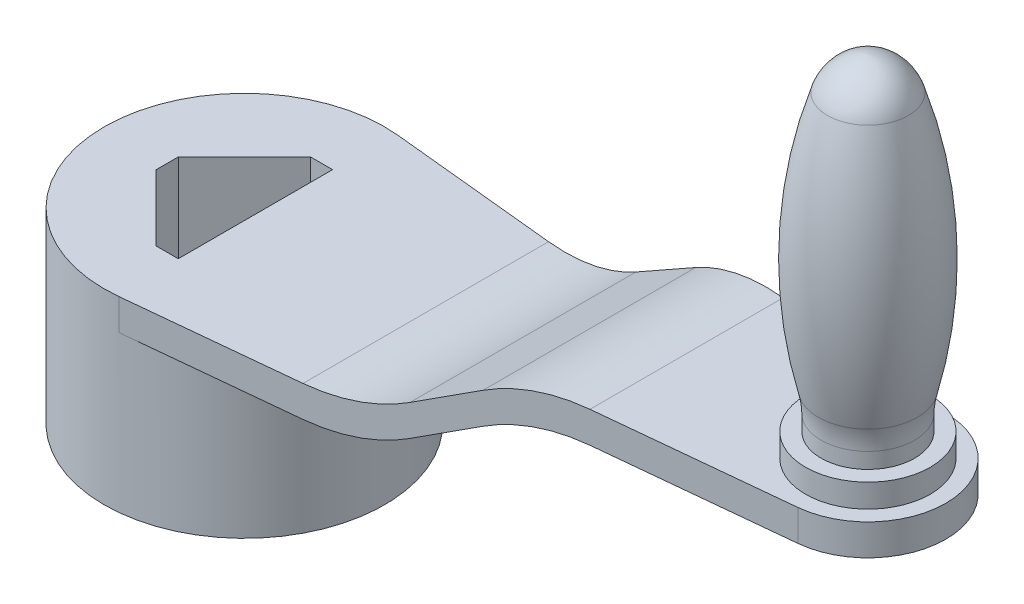
ISO-10303-21;
HEADER;
FILE_DESCRIPTION(('STEP AP214'),'2;1');
FILE_NAME('part.step','',(''),(''),'','','');
FILE_SCHEMA(('AUTOMOTIVE_DESIGN { 1 0 10303 214 1 1 1 1 }'));
ENDSEC;
DATA;
#1=APPLICATION_CONTEXT('core data for automotive mechanical design processes');
#2=APPLICATION_PROTOCOL_DEFINITION('international standard','automotive_design',2000,#1);
#3=PRODUCT_CONTEXT('',#1,'mechanical');
#4=PRODUCT('Part','Part','',(#3));
#5=PRODUCT_RELATED_PRODUCT_CATEGORY('part','',(#4));
#6=PRODUCT_DEFINITION_FORMATION('','',#4);
#7=PRODUCT_DEFINITION_CONTEXT('part definition',#1,'design');
#8=PRODUCT_DEFINITION('design','',#6,#7);
#9=PRODUCT_DEFINITION_SHAPE('','',#8);
#10=(LENGTH_UNIT() NAMED_UNIT(*) SI_UNIT(.MILLI.,.METRE.));
#11=(NAMED_UNIT(*) PLANE_ANGLE_UNIT() SI_UNIT($,.RADIAN.));
#12=(NAMED_UNIT(*) SI_UNIT($,.STERADIAN.) SOLID_ANGLE_UNIT());
#13=UNCERTAINTY_MEASURE_WITH_UNIT(LENGTH_MEASURE(1.E-05),#10,'distance_accuracy_value','');
#14=(GEOMETRIC_REPRESENTATION_CONTEXT(3) GLOBAL_UNCERTAINTY_ASSIGNED_CONTEXT((#13)) GLOBAL_UNIT_ASSIGNED_CONTEXT((#10,
#11,#12)) REPRESENTATION_CONTEXT('',''));
#15=CARTESIAN_POINT('',(0.,0.,0.));
#16=DIRECTION('',(0.,0.,1.));
#17=DIRECTION('',(1.,0.,0.));
#18=AXIS2_PLACEMENT_3D('',#15,#16,#17);
#19=CARTESIAN_POINT('',(141.822000133057,0.42851454593254,45.));
#20=DIRECTION('',(0.,0.,-1.));
#21=DIRECTION('',(-1.,0.,0.));
#22=AXIS2_PLACEMENT_3D('',#19,#20,#21);
#23=CYLINDRICAL_SURFACE('',#22,60.0000000000006);
#24=CARTESIAN_POINT('',(141.822000133057,0.42851454593254,30.9730543697226));
#25=DIRECTION('',(0.1,0.,0.99498743710662));
#26=DIRECTION('',(0.99498743710662,0.,-0.1));
#27=AXIS2_PLACEMENT_3D('',#24,#25,#26);
#28=ELLIPSE('',#27,60.3022689155533,60.0000000000006);
#29=CARTESIAN_POINT('',(141.822000133057,60.4285145459332,30.9730543697226));
#30=VERTEX_POINT('',#29);
#31=CARTESIAN_POINT('',(110.629871748391,51.683281415313,34.1079812262236));
#32=VERTEX_POINT('',#31);
#33=EDGE_CURVE('E326',#30,#32,#28,.T.);
#34=ORIENTED_EDGE('',*,*,#33,.F.);
#35=DIRECTION('',(0.,0.,-1.));
#36=VECTOR('',#35,1.);
#37=CARTESIAN_POINT('',(141.822000133058,60.4285145459332,45.));
#38=LINE('',#37,#36);
#39=CARTESIAN_POINT('',(141.822000133057,60.4285145459332,-30.9730543697226));
#40=VERTEX_POINT('',#39);
#41=EDGE_CURVE('E344',#30,#40,#38,.T.);
#42=ORIENTED_EDGE('',*,*,#41,.T.);
#43=CARTESIAN_POINT('',(141.822000133057,0.42851454593254,-30.9730543697226));
#44=DIRECTION('',(-0.1,0.,0.99498743710662));
#45=DIRECTION('',(-0.99498743710662,0.,-0.1));
#46=AXIS2_PLACEMENT_3D('',#43,#44,#45);
#47=ELLIPSE('',#46,60.3022689155533,60.0000000000006);
#48=CARTESIAN_POINT('',(110.629871748391,51.683281415313,-34.1079812262236));
#49=VERTEX_POINT('',#48);
#50=EDGE_CURVE('E785',#40,#49,#47,.T.);
#51=ORIENTED_EDGE('',*,*,#50,.T.);
#52=DIRECTION('',(0.,0.,-1.));
#53=VECTOR('',#52,1.);
#54=CARTESIAN_POINT('',(110.629871748391,51.6832814153132,45.));
#55=LINE('',#54,#53);
#56=EDGE_CURVE('E336',#32,#49,#55,.T.);
#57=ORIENTED_EDGE('',*,*,#56,.F.);
#58=EDGE_LOOP('',(#34,#42,#51,#57));
#59=FACE_BOUND('',#58,.T.);
#60=ADVANCED_FACE('F43',(#59),#23,.T.);
#61=CARTESIAN_POINT('',(0.,30.,0.));
#62=DIRECTION('',(0.,1.,0.));
#63=DIRECTION('',(0.,0.,1.));
#64=AXIS2_PLACEMENT_3D('',#61,#62,#63);
#65=PLANE('',#64);
#66=DIRECTION('',(0.,0.,-1.));
#67=VECTOR('',#66,1.);
#68=CARTESIAN_POINT('',(3.53553390593271,30.,45.));
#69=LINE('',#68,#67);
#70=CARTESIAN_POINT('',(3.53553390593271,30.,24.7487373415291));
#71=VERTEX_POINT('',#70);
#72=CARTESIAN_POINT('',(3.53553390593271,30.,-24.7487373415291));
#73=VERTEX_POINT('',#72);
#74=EDGE_CURVE('E363',#71,#73,#69,.T.);
#75=ORIENTED_EDGE('',*,*,#74,.F.);
#76=DIRECTION('',(1.,0.,0.));
#77=VECTOR('',#76,1.);
#78=CARTESIAN_POINT('',(3.53553390593271,30.,24.7487373415291));
#79=LINE('',#78,#77);
#80=CARTESIAN_POINT('',(-3.53553390593275,30.,24.7487373415291));
#81=VERTEX_POINT('',#80);
#82=EDGE_CURVE('E378',#81,#71,#79,.T.);
#83=ORIENTED_EDGE('',*,*,#82,.F.);
#84=DIRECTION('',(0.707106781186549,0.,0.707106781186546));
#85=VECTOR('',#84,1.);
#86=CARTESIAN_POINT('',(-3.53553390593275,30.,24.7487373415291));
#87=LINE('',#86,#85);
#88=CARTESIAN_POINT('',(-24.7487373415292,30.,3.53553390593273));
#89=VERTEX_POINT('',#88);
#90=EDGE_CURVE('E383',#89,#81,#87,.T.);
#91=ORIENTED_EDGE('',*,*,#90,.F.);
#92=DIRECTION('',(0.,0.,1.));
#93=VECTOR('',#92,1.);
#94=CARTESIAN_POINT('',(-24.7487373415292,30.,3.53553390593273));
#95=LINE('',#94,#93);
#96=CARTESIAN_POINT('',(-24.7487373415292,30.,-3.53553390593273));
#97=VERTEX_POINT('',#96);
#98=EDGE_CURVE('E419',#97,#89,#95,.T.);
#99=ORIENTED_EDGE('',*,*,#98,.F.);
#100=DIRECTION('',(-0.707106781186549,0.,0.707106781186546));
#101=VECTOR('',#100,1.);
#102=CARTESIAN_POINT('',(-24.7487373415292,30.,-3.53553390593273));
#103=LINE('',#102,#101);
#104=CARTESIAN_POINT('',(-3.53553390593274,30.,-24.7487373415291));
#105=VERTEX_POINT('',#104);
#106=EDGE_CURVE('E415',#105,#97,#103,.T.);
#107=ORIENTED_EDGE('',*,*,#106,.F.);
#108=DIRECTION('',(-1.,0.,0.));
#109=VECTOR('',#108,1.);
#110=CARTESIAN_POINT('',(-3.53553390593274,30.,-24.7487373415291));
#111=LINE('',#110,#109);
#112=EDGE_CURVE('E411',#73,#105,#111,.T.);
#113=ORIENTED_EDGE('',*,*,#112,.F.);
#114=EDGE_LOOP('',(#75,#83,#91,#99,#107,#113));
#115=FACE_BOUND('',#114,.T.);
#116=CARTESIAN_POINT('',(0.,30.,0.));
#117=DIRECTION('',(0.,1.,0.));
#118=DIRECTION('',(0.,0.,1.));
#119=AXIS2_PLACEMENT_3D('',#116,#117,#118);
#120=CIRCLE('',#119,45.);
#121=CARTESIAN_POINT('',(4.50000000000037,30.,-44.7744346697979));
#122=VERTEX_POINT('',#121);
#123=CARTESIAN_POINT('',(4.50000000000037,30.,44.7744346697979));
#124=VERTEX_POINT('',#123);
#125=EDGE_CURVE('E289',#122,#124,#120,.T.);
#126=ORIENTED_EDGE('',*,*,#125,.T.);
#127=DIRECTION('',(0.99498743710662,0.,-0.1));
#128=VECTOR('',#127,1.);
#129=CARTESIAN_POINT('',(4.50000000000001,30.,44.7744346697979));
#130=LINE('',#129,#128);
#131=CARTESIAN_POINT('',(58.1779998669424,29.9999999999999,39.3795926984223));
#132=VERTEX_POINT('',#131);
#133=EDGE_CURVE('E313',#124,#132,#130,.T.);
#134=ORIENTED_EDGE('',*,*,#133,.T.);
#135=DIRECTION('',(0.,0.,-1.));
#136=VECTOR('',#135,1.);
#137=CARTESIAN_POINT('',(58.1779998669424,29.9999999999999,45.));
#138=LINE('',#137,#136);
#139=CARTESIAN_POINT('',(58.1779998669424,29.9999999999999,-39.3795926984223));
#140=VERTEX_POINT('',#139);
#141=EDGE_CURVE('E322',#132,#140,#138,.T.);
#142=ORIENTED_EDGE('',*,*,#141,.T.);
#143=DIRECTION('',(0.99498743710662,0.,0.1));
#144=VECTOR('',#143,1.);
#145=CARTESIAN_POINT('',(4.50000000000001,30.,-44.7744346697979));
#146=LINE('',#145,#144);
#147=EDGE_CURVE('E782',#122,#140,#146,.T.);
#148=ORIENTED_EDGE('',*,*,#147,.F.);
#149=EDGE_LOOP('',(#126,#134,#142,#148));
#150=FACE_BOUND('',#149,.T.);
#151=ADVANCED_FACE('F202',(#115,#150),#65,.T.);
#152=CARTESIAN_POINT('',(200.,50.4285145459325,45.));
#153=DIRECTION('',(0.,1.,0.));
#154=DIRECTION('',(0.,0.,1.));
#155=AXIS2_PLACEMENT_3D('',#152,#153,#154);
#156=PLANE('',#155);
#157=DIRECTION('',(0.99498743710662,0.,-0.1));
#158=VECTOR('',#157,1.);
#159=CARTESIAN_POINT('',(198.02255653302,50.4285145459325,25.3246859276655));
#160=LINE('',#159,#158);
#161=CARTESIAN_POINT('',(141.822000133057,50.4285145459327,30.9730543697227));
#162=VERTEX_POINT('',#161);
#163=CARTESIAN_POINT('',(202.5,50.4285145459325,24.8746859276655));
#164=VERTEX_POINT('',#163);
#165=EDGE_CURVE('E796',#162,#164,#160,.T.);
#166=ORIENTED_EDGE('',*,*,#165,.F.);
#167=DIRECTION('',(0.,0.,-1.));
#168=VECTOR('',#167,1.);
#169=CARTESIAN_POINT('',(141.822000133057,50.4285145459327,45.));
#170=LINE('',#169,#168);
#171=CARTESIAN_POINT('',(141.822000133057,50.4285145459325,-30.9730543697227));
#172=VERTEX_POINT('',#171);
#173=EDGE_CURVE('E347',#162,#172,#170,.T.);
#174=ORIENTED_EDGE('',*,*,#173,.T.);
#175=DIRECTION('',(0.99498743710662,0.,0.1));
#176=VECTOR('',#175,1.);
#177=CARTESIAN_POINT('',(206.97744346698,50.4285145459325,-24.4246859276655));
#178=LINE('',#177,#176);
#179=CARTESIAN_POINT('',(202.5,50.4285145459325,-24.8746859276655));
#180=VERTEX_POINT('',#179);
#181=EDGE_CURVE('E778',#172,#180,#178,.T.);
#182=ORIENTED_EDGE('',*,*,#181,.T.);
#183=CARTESIAN_POINT('',(200.,50.4285145459325,0.));
#184=DIRECTION('',(0.,1.,0.));
#185=DIRECTION('',(0.,0.,1.));
#186=AXIS2_PLACEMENT_3D('',#183,#184,#185);
#187=CIRCLE('',#186,25.);
#188=EDGE_CURVE('E332',#164,#180,#187,.T.);
#189=ORIENTED_EDGE('',*,*,#188,.F.);
#190=EDGE_LOOP('',(#166,#174,#182,#189));
#191=FACE_BOUND('',#190,.T.);
#192=ADVANCED_FACE('F208',(#191),#156,.F.);
#193=CARTESIAN_POINT('',(3.53553390593272,20.,45.));
#194=DIRECTION('',(0.,1.,0.));
#195=DIRECTION('',(-1.,0.,0.));
#196=AXIS2_PLACEMENT_3D('',#193,#194,#195);
#197=PLANE('',#196);
#198=DIRECTION('',(0.99498743710662,0.,-0.1));
#199=VECTOR('',#198,1.);
#200=CARTESIAN_POINT('',(3.5227350998936,20.,44.8726534878112));
#201=LINE('',#200,#199);
#202=CARTESIAN_POINT('',(4.50000000000037,20.,44.7744346697979));
#203=VERTEX_POINT('',#202);
#204=CARTESIAN_POINT('',(58.1779998669417,20.,39.3795926984224));
#205=VERTEX_POINT('',#204);
#206=EDGE_CURVE('E761',#203,#205,#201,.T.);
#207=ORIENTED_EDGE('',*,*,#206,.F.);
#208=CARTESIAN_POINT('',(0.,20.,0.));
#209=DIRECTION('',(0.,1.,0.));
#210=DIRECTION('',(-1.,0.,0.));
#211=AXIS2_PLACEMENT_3D('',#208,#209,#210);
#212=CIRCLE('',#211,45.);
#213=CARTESIAN_POINT('',(4.50000000000037,20.,-44.7744346697979));
#214=VERTEX_POINT('',#213);
#215=EDGE_CURVE('E371',#203,#214,#212,.T.);
#216=ORIENTED_EDGE('',*,*,#215,.T.);
#217=DIRECTION('',(0.99498743710662,0.,0.1));
#218=VECTOR('',#217,1.);
#219=CARTESIAN_POINT('',(12.4776220338532,20.,-43.9726534878112));
#220=LINE('',#219,#218);
#221=CARTESIAN_POINT('',(58.1779998669417,20.,-39.3795926984224));
#222=VERTEX_POINT('',#221);
#223=EDGE_CURVE('E338',#214,#222,#220,.T.);
#224=ORIENTED_EDGE('',*,*,#223,.T.);
#225=DIRECTION('',(0.,0.,-1.));
#226=VECTOR('',#225,1.);
#227=CARTESIAN_POINT('',(58.1779998669417,20.,45.));
#228=LINE('',#227,#226);
#229=EDGE_CURVE('E356',#205,#222,#228,.T.);
#230=ORIENTED_EDGE('',*,*,#229,.F.);
#231=EDGE_LOOP('',(#207,#216,#224,#230));
#232=FACE_BOUND('',#231,.T.);
#233=ADVANCED_FACE('F223',(#232),#197,.F.);
#234=CARTESIAN_POINT('',(58.1779998669427,80.,45.));
#235=DIRECTION('',(0.,0.,-1.));
#236=DIRECTION('',(-1.,0.,0.));
#237=AXIS2_PLACEMENT_3D('',#234,#235,#236);
#238=CYLINDRICAL_SURFACE('',#237,59.9999999999997);
#239=CARTESIAN_POINT('',(58.1779998669427,80.,39.3795926984223));
#240=DIRECTION('',(0.1,0.,0.99498743710662));
#241=DIRECTION('',(0.99498743710662,0.,-0.1));
#242=AXIS2_PLACEMENT_3D('',#239,#240,#241);
#243=ELLIPSE('',#242,60.3022689155524,59.9999999999997);
#244=CARTESIAN_POINT('',(89.3701282516084,28.7452331306203,36.2446658419214));
#245=VERTEX_POINT('',#244);
#246=EDGE_CURVE('E803',#205,#245,#243,.T.);
#247=ORIENTED_EDGE('',*,*,#246,.F.);
#248=ORIENTED_EDGE('',*,*,#229,.T.);
#249=CARTESIAN_POINT('',(58.1779998669427,80.,-39.3795926984223));
#250=DIRECTION('',(-0.1,0.,0.99498743710662));
#251=DIRECTION('',(-0.99498743710662,0.,-0.1));
#252=AXIS2_PLACEMENT_3D('',#249,#250,#251);
#253=ELLIPSE('',#252,60.3022689155524,59.9999999999997);
#254=CARTESIAN_POINT('',(89.3701282516084,28.7452331306203,-36.2446658419214));
#255=VERTEX_POINT('',#254);
#256=EDGE_CURVE('E765',#222,#255,#253,.T.);
#257=ORIENTED_EDGE('',*,*,#256,.T.);
#258=DIRECTION('',(0.,0.,-1.));
#259=VECTOR('',#258,1.);
#260=CARTESIAN_POINT('',(89.3701282516084,28.74523313062,45.));
#261=LINE('',#260,#259);
#262=EDGE_CURVE('E353',#245,#255,#261,.T.);
#263=ORIENTED_EDGE('',*,*,#262,.F.);
#264=EDGE_LOOP('',(#247,#248,#257,#263));
#265=FACE_BOUND('',#264,.T.);
#266=ADVANCED_FACE('F232',(#265),#238,.T.);
#267=CARTESIAN_POINT('',(89.3701282516082,28.7452331306202,45.));
#268=DIRECTION('',(-0.519868806411113,0.854246114489662,0.));
#269=DIRECTION('',(-0.854246114489662,-0.519868806411113,0.));
#270=AXIS2_PLACEMENT_3D('',#267,#268,#269);
#271=PLANE('',#270);
#272=DIRECTION('',(0.851115057254111,0.517963337998391,-0.0855402817676892));
#273=VECTOR('',#272,1.);
#274=CARTESIAN_POINT('',(88.732699459372,28.3573129050891,36.3087298459946));
#275=LINE('',#274,#273);
#276=CARTESIAN_POINT('',(110.62987174839,41.683281415313,34.1079812262237));
#277=VERTEX_POINT('',#276);
#278=EDGE_CURVE('E806',#245,#277,#275,.T.);
#279=ORIENTED_EDGE('',*,*,#278,.F.);
#280=ORIENTED_EDGE('',*,*,#262,.T.);
#281=DIRECTION('',(0.851115057254111,0.517963337998391,0.0855402817676892));
#282=VECTOR('',#281,1.);
#283=CARTESIAN_POINT('',(95.2851154226536,32.3449185940834,-35.650187263554));
#284=LINE('',#283,#282);
#285=CARTESIAN_POINT('',(110.62987174839,41.683281415313,-34.1079812262237));
#286=VERTEX_POINT('',#285);
#287=EDGE_CURVE('E768',#255,#286,#284,.T.);
#288=ORIENTED_EDGE('',*,*,#287,.T.);
#289=DIRECTION('',(0.,0.,-1.));
#290=VECTOR('',#289,1.);
#291=CARTESIAN_POINT('',(110.62987174839,41.683281415313,45.));
#292=LINE('',#291,#290);
#293=EDGE_CURVE('E350',#277,#286,#292,.T.);
#294=ORIENTED_EDGE('',*,*,#293,.F.);
#295=EDGE_LOOP('',(#279,#280,#288,#294));
#296=FACE_BOUND('',#295,.T.);
#297=ADVANCED_FACE('F228',(#296),#271,.F.);
#298=CARTESIAN_POINT('',(141.822000133057,-9.57148545406746,45.));
#299=DIRECTION('',(0.,0.,-1.));
#300=DIRECTION('',(-1.,0.,0.));
#301=AXIS2_PLACEMENT_3D('',#298,#299,#300);
#302=CYLINDRICAL_SURFACE('',#301,60.0000000000002);
#303=CARTESIAN_POINT('',(141.822000133057,-9.57148545406746,30.9730543697226));
#304=DIRECTION('',(0.1,0.,0.99498743710662));
#305=DIRECTION('',(0.99498743710662,0.,-0.1));
#306=AXIS2_PLACEMENT_3D('',#303,#304,#305);
#307=ELLIPSE('',#306,60.3022689155529,60.0000000000002);
#308=EDGE_CURVE('E325',#277,#162,#307,.F.);
#309=ORIENTED_EDGE('',*,*,#308,.F.);
#310=ORIENTED_EDGE('',*,*,#293,.T.);
#311=CARTESIAN_POINT('',(141.822000133057,-9.57148545406746,-30.9730543697226));
#312=DIRECTION('',(-0.1,0.,0.99498743710662));
#313=DIRECTION('',(-0.99498743710662,0.,-0.1));
#314=AXIS2_PLACEMENT_3D('',#311,#312,#313);
#315=ELLIPSE('',#314,60.3022689155529,60.0000000000002);
#316=EDGE_CURVE('E774',#286,#172,#315,.F.);
#317=ORIENTED_EDGE('',*,*,#316,.T.);
#318=ORIENTED_EDGE('',*,*,#173,.F.);
#319=EDGE_LOOP('',(#309,#310,#317,#318));
#320=FACE_BOUND('',#319,.T.);
#321=ADVANCED_FACE('F225',(#320),#302,.F.);
#322=CARTESIAN_POINT('',(89.3701282516089,38.7452331306202,45.));
#323=DIRECTION('',(0.519868806411113,-0.854246114489662,0.));
#324=DIRECTION('',(0.854246114489662,0.519868806411113,0.));
#325=AXIS2_PLACEMENT_3D('',#322,#323,#324);
#326=PLANE('',#325);
#327=DIRECTION('',(-0.851115057254111,-0.517963337998391,0.0855402817676893));
#328=VECTOR('',#327,1.);
#329=CARTESIAN_POINT('',(88.7326994593727,38.3573129050891,36.3087298459945));
#330=LINE('',#329,#328);
#331=CARTESIAN_POINT('',(89.3701282516089,38.7452331306202,36.2446658419213));
#332=VERTEX_POINT('',#331);
#333=EDGE_CURVE('E316',#32,#332,#330,.T.);
#334=ORIENTED_EDGE('',*,*,#333,.F.);
#335=ORIENTED_EDGE('',*,*,#56,.T.);
#336=DIRECTION('',(-0.851115057254111,-0.517963337998391,-0.0855402817676893));
#337=VECTOR('',#336,1.);
#338=CARTESIAN_POINT('',(95.2851154226543,42.3449185940834,-35.650187263554));
#339=LINE('',#338,#337);
#340=CARTESIAN_POINT('',(89.3701282516089,38.7452331306202,-36.2446658419213));
#341=VERTEX_POINT('',#340);
#342=EDGE_CURVE('E789',#49,#341,#339,.T.);
#343=ORIENTED_EDGE('',*,*,#342,.T.);
#344=DIRECTION('',(0.,0.,-1.));
#345=VECTOR('',#344,1.);
#346=CARTESIAN_POINT('',(89.3701282516089,38.7452331306202,45.));
#347=LINE('',#346,#345);
#348=EDGE_CURVE('E331',#332,#341,#347,.T.);
#349=ORIENTED_EDGE('',*,*,#348,.F.);
#350=EDGE_LOOP('',(#334,#335,#343,#349));
#351=FACE_BOUND('',#350,.T.);
#352=ADVANCED_FACE('F213',(#351),#326,.F.);
#353=CARTESIAN_POINT('',(58.177999866942,90.0000000000002,45.));
#354=DIRECTION('',(0.,0.,-1.));
#355=DIRECTION('',(-1.,0.,0.));
#356=AXIS2_PLACEMENT_3D('',#353,#354,#355);
#357=CYLINDRICAL_SURFACE('',#356,60.0000000000003);
#358=CARTESIAN_POINT('',(58.177999866942,90.0000000000002,39.3795926984224));
#359=DIRECTION('',(0.1,0.,0.99498743710662));
#360=DIRECTION('',(0.99498743710662,0.,-0.1));
#361=AXIS2_PLACEMENT_3D('',#358,#359,#360);
#362=ELLIPSE('',#361,60.302268915553,60.0000000000003);
#363=EDGE_CURVE('E52',#332,#132,#362,.F.);
#364=ORIENTED_EDGE('',*,*,#363,.F.);
#365=ORIENTED_EDGE('',*,*,#348,.T.);
#366=CARTESIAN_POINT('',(58.177999866942,90.0000000000002,-39.3795926984223));
#367=DIRECTION('',(-0.1,0.,0.99498743710662));
#368=DIRECTION('',(-0.99498743710662,0.,-0.1));
#369=AXIS2_PLACEMENT_3D('',#366,#367,#368);
#370=ELLIPSE('',#369,60.302268915553,60.0000000000003);
#371=EDGE_CURVE('E303',#341,#140,#370,.F.);
#372=ORIENTED_EDGE('',*,*,#371,.T.);
#373=ORIENTED_EDGE('',*,*,#141,.F.);
#374=EDGE_LOOP('',(#364,#365,#372,#373));
#375=FACE_BOUND('',#374,.T.);
#376=ADVANCED_FACE('F328',(#375),#357,.F.);
#377=CARTESIAN_POINT('',(0.,30.,0.));
#378=DIRECTION('',(0.,-1.,0.));
#379=DIRECTION('',(0.,0.,-1.));
#380=AXIS2_PLACEMENT_3D('',#377,#378,#379);
#381=CYLINDRICAL_SURFACE('',#380,45.);
#382=CARTESIAN_POINT('',(0.,-30.,0.));
#383=DIRECTION('',(0.,1.,0.));
#384=DIRECTION('',(0.,0.,1.));
#385=AXIS2_PLACEMENT_3D('',#382,#383,#384);
#386=CIRCLE('',#385,45.);
#387=CARTESIAN_POINT('',(0.,-30.,45.));
#388=VERTEX_POINT('',#387);
#389=EDGE_CURVE('E286',#388,#388,#386,.T.);
#390=ORIENTED_EDGE('',*,*,#389,.T.);
#391=EDGE_LOOP('',(#390));
#392=FACE_BOUND('',#391,.T.);
#393=ORIENTED_EDGE('',*,*,#215,.F.);
#394=DIRECTION('',(0.,1.,0.));
#395=VECTOR('',#394,1.);
#396=CARTESIAN_POINT('',(4.50000000000037,-30.,44.7744346697979));
#397=LINE('',#396,#395);
#398=EDGE_CURVE('E754',#203,#124,#397,.T.);
#399=ORIENTED_EDGE('',*,*,#398,.T.);
#400=ORIENTED_EDGE('',*,*,#125,.F.);
#401=DIRECTION('',(0.,1.,0.));
#402=VECTOR('',#401,1.);
#403=CARTESIAN_POINT('',(4.50000000000037,-30.,-44.7744346697979));
#404=LINE('',#403,#402);
#405=EDGE_CURVE('E756',#214,#122,#404,.T.);
#406=ORIENTED_EDGE('',*,*,#405,.F.);
#407=EDGE_LOOP('',(#393,#399,#400,#406));
#408=FACE_BOUND('',#407,.T.);
#409=ADVANCED_FACE('F45',(#392,#408),#381,.T.);
#410=CARTESIAN_POINT('',(3.53553390593271,-30.,-24.7487373415291));
#411=DIRECTION('',(0.707106781186551,0.,-0.707106781186544));
#412=DIRECTION('',(-0.707106781186544,0.,-0.707106781186551));
#413=AXIS2_PLACEMENT_3D('',#410,#411,#412);
#414=PLANE('',#413);
#415=DIRECTION('',(0.707106781186544,0.,0.707106781186551));
#416=VECTOR('',#415,1.);
#417=CARTESIAN_POINT('',(3.53553390593271,20.,-24.7487373415291));
#418=LINE('',#417,#416);
#419=CARTESIAN_POINT('',(3.53553390593271,20.,-24.7487373415291));
#420=VERTEX_POINT('',#419);
#421=CARTESIAN_POINT('',(24.7487373415288,20.,-3.53553390593276));
#422=VERTEX_POINT('',#421);
#423=EDGE_CURVE('E59',#420,#422,#418,.T.);
#424=ORIENTED_EDGE('',*,*,#423,.F.);
#425=DIRECTION('',(0.,1.,0.));
#426=VECTOR('',#425,1.);
#427=CARTESIAN_POINT('',(3.53553390593271,-30.,-24.7487373415291));
#428=LINE('',#427,#426);
#429=CARTESIAN_POINT('',(3.53553390593271,-30.,-24.7487373415291));
#430=VERTEX_POINT('',#429);
#431=EDGE_CURVE('E434',#430,#420,#428,.T.);
#432=ORIENTED_EDGE('',*,*,#431,.F.);
#433=DIRECTION('',(-0.707106781186544,0.,-0.707106781186551));
#434=VECTOR('',#433,1.);
#435=CARTESIAN_POINT('',(3.53553390593271,-30.,-24.7487373415291));
#436=LINE('',#435,#434);
#437=CARTESIAN_POINT('',(24.7487373415288,-30.,-3.53553390593276));
#438=VERTEX_POINT('',#437);
#439=EDGE_CURVE('E391',#438,#430,#436,.T.);
#440=ORIENTED_EDGE('',*,*,#439,.F.);
#441=DIRECTION('',(0.,1.,0.));
#442=VECTOR('',#441,1.);
#443=CARTESIAN_POINT('',(24.7487373415288,-30.,-3.53553390593276));
#444=LINE('',#443,#442);
#445=EDGE_CURVE('E437',#438,#422,#444,.T.);
#446=ORIENTED_EDGE('',*,*,#445,.T.);
#447=EDGE_LOOP('',(#424,#432,#440,#446));
#448=FACE_BOUND('',#447,.T.);
#449=ADVANCED_FACE('F261',(#448),#414,.F.);
#450=CARTESIAN_POINT('',(24.7487373415288,-30.,-3.53553390593276));
#451=DIRECTION('',(1.,0.,0.));
#452=DIRECTION('',(0.,0.,-1.));
#453=AXIS2_PLACEMENT_3D('',#450,#451,#452);
#454=PLANE('',#453);
#455=DIRECTION('',(0.,0.,1.));
#456=VECTOR('',#455,1.);
#457=CARTESIAN_POINT('',(24.7487373415288,20.,-3.53553390593276));
#458=LINE('',#457,#456);
#459=CARTESIAN_POINT('',(24.7487373415288,20.,3.53553390593276));
#460=VERTEX_POINT('',#459);
#461=EDGE_CURVE('E67',#422,#460,#458,.T.);
#462=ORIENTED_EDGE('',*,*,#461,.F.);
#463=ORIENTED_EDGE('',*,*,#445,.F.);
#464=DIRECTION('',(0.,0.,-1.));
#465=VECTOR('',#464,1.);
#466=CARTESIAN_POINT('',(24.7487373415288,-30.,-3.53553390593276));
#467=LINE('',#466,#465);
#468=CARTESIAN_POINT('',(24.7487373415288,-30.,3.53553390593276));
#469=VERTEX_POINT('',#468);
#470=EDGE_CURVE('E387',#469,#438,#467,.T.);
#471=ORIENTED_EDGE('',*,*,#470,.F.);
#472=DIRECTION('',(0.,1.,0.));
#473=VECTOR('',#472,1.);
#474=CARTESIAN_POINT('',(24.7487373415288,-30.,3.53553390593276));
#475=LINE('',#474,#473);
#476=EDGE_CURVE('E440',#469,#460,#475,.T.);
#477=ORIENTED_EDGE('',*,*,#476,.T.);
#478=EDGE_LOOP('',(#462,#463,#471,#477));
#479=FACE_BOUND('',#478,.T.);
#480=ADVANCED_FACE('F264',(#479),#454,.F.);
#481=CARTESIAN_POINT('',(24.7487373415288,-30.,3.53553390593276));
#482=DIRECTION('',(0.707106781186551,0.,0.707106781186544));
#483=DIRECTION('',(0.707106781186544,0.,-0.707106781186551));
#484=AXIS2_PLACEMENT_3D('',#481,#482,#483);
#485=PLANE('',#484);
#486=DIRECTION('',(-0.707106781186544,0.,0.707106781186551));
#487=VECTOR('',#486,1.);
#488=CARTESIAN_POINT('',(24.7487373415288,20.,3.53553390593276));
#489=LINE('',#488,#487);
#490=CARTESIAN_POINT('',(3.53553390593272,20.,24.7487373415291));
#491=VERTEX_POINT('',#490);
#492=EDGE_CURVE('E294',#460,#491,#489,.T.);
#493=ORIENTED_EDGE('',*,*,#492,.F.);
#494=ORIENTED_EDGE('',*,*,#476,.F.);
#495=DIRECTION('',(0.707106781186544,0.,-0.707106781186551));
#496=VECTOR('',#495,1.);
#497=CARTESIAN_POINT('',(24.7487373415288,-30.,3.53553390593276));
#498=LINE('',#497,#496);
#499=CARTESIAN_POINT('',(3.53553390593271,-30.,24.7487373415291));
#500=VERTEX_POINT('',#499);
#501=EDGE_CURVE('E382',#500,#469,#498,.T.);
#502=ORIENTED_EDGE('',*,*,#501,.F.);
#503=DIRECTION('',(0.,1.,0.));
#504=VECTOR('',#503,1.);
#505=CARTESIAN_POINT('',(3.53553390593271,-30.,24.7487373415291));
#506=LINE('',#505,#504);
#507=EDGE_CURVE('E442',#500,#491,#506,.T.);
#508=ORIENTED_EDGE('',*,*,#507,.T.);
#509=EDGE_LOOP('',(#493,#494,#502,#508));
#510=FACE_BOUND('',#509,.T.);
#511=ADVANCED_FACE('F267',(#510),#485,.F.);
#512=CARTESIAN_POINT('',(0.,-30.,0.));
#513=DIRECTION('',(0.,1.,0.));
#514=DIRECTION('',(0.,0.,1.));
#515=AXIS2_PLACEMENT_3D('',#512,#513,#514);
#516=PLANE('',#515);
#517=DIRECTION('',(0.707106781186549,0.,0.707106781186546));
#518=VECTOR('',#517,1.);
#519=CARTESIAN_POINT('',(-3.53553390593275,-30.,24.7487373415291));
#520=LINE('',#519,#518);
#521=CARTESIAN_POINT('',(-24.7487373415292,-30.,3.53553390593273));
#522=VERTEX_POINT('',#521);
#523=CARTESIAN_POINT('',(-3.53553390593275,-30.,24.7487373415291));
#524=VERTEX_POINT('',#523);
#525=EDGE_CURVE('E283',#522,#524,#520,.T.);
#526=ORIENTED_EDGE('',*,*,#525,.T.);
#527=DIRECTION('',(1.,0.,0.));
#528=VECTOR('',#527,1.);
#529=CARTESIAN_POINT('',(3.53553390593271,-30.,24.7487373415291));
#530=LINE('',#529,#528);
#531=EDGE_CURVE('E379',#524,#500,#530,.T.);
#532=ORIENTED_EDGE('',*,*,#531,.T.);
#533=ORIENTED_EDGE('',*,*,#501,.T.);
#534=ORIENTED_EDGE('',*,*,#470,.T.);
#535=ORIENTED_EDGE('',*,*,#439,.T.);
#536=DIRECTION('',(-1.,0.,0.));
#537=VECTOR('',#536,1.);
#538=CARTESIAN_POINT('',(-3.53553390593274,-30.,-24.7487373415291));
#539=LINE('',#538,#537);
#540=CARTESIAN_POINT('',(-3.53553390593274,-30.,-24.7487373415291));
#541=VERTEX_POINT('',#540);
#542=EDGE_CURVE('E395',#430,#541,#539,.T.);
#543=ORIENTED_EDGE('',*,*,#542,.T.);
#544=DIRECTION('',(-0.707106781186549,0.,0.707106781186546));
#545=VECTOR('',#544,1.);
#546=CARTESIAN_POINT('',(-24.7487373415292,-30.,-3.53553390593273));
#547=LINE('',#546,#545);
#548=CARTESIAN_POINT('',(-24.7487373415292,-30.,-3.53553390593273));
#549=VERTEX_POINT('',#548);
#550=EDGE_CURVE('E399',#541,#549,#547,.T.);
#551=ORIENTED_EDGE('',*,*,#550,.T.);
#552=DIRECTION('',(0.,0.,1.));
#553=VECTOR('',#552,1.);
#554=CARTESIAN_POINT('',(-24.7487373415292,-30.,3.53553390593273));
#555=LINE('',#554,#553);
#556=EDGE_CURVE('E403',#549,#522,#555,.T.);
#557=ORIENTED_EDGE('',*,*,#556,.T.);
#558=EDGE_LOOP('',(#526,#532,#533,#534,#535,#543,#551,#557));
#559=FACE_BOUND('',#558,.T.);
#560=ORIENTED_EDGE('',*,*,#389,.F.);
#561=EDGE_LOOP('',(#560));
#562=FACE_BOUND('',#561,.T.);
#563=ADVANCED_FACE('F270',(#559,#562),#516,.F.);
#564=CARTESIAN_POINT('',(3.53553390593271,-30.,24.7487373415291));
#565=DIRECTION('',(0.,0.,1.));
#566=DIRECTION('',(1.,0.,0.));
#567=AXIS2_PLACEMENT_3D('',#564,#565,#566);
#568=PLANE('',#567);
#569=ORIENTED_EDGE('',*,*,#82,.T.);
#570=EDGE_CURVE('E408',#491,#71,#506,.T.);
#571=ORIENTED_EDGE('',*,*,#570,.F.);
#572=ORIENTED_EDGE('',*,*,#507,.F.);
#573=ORIENTED_EDGE('',*,*,#531,.F.);
#574=DIRECTION('',(0.,1.,0.));
#575=VECTOR('',#574,1.);
#576=CARTESIAN_POINT('',(-3.53553390593275,-30.,24.7487373415291));
#577=LINE('',#576,#575);
#578=EDGE_CURVE('E290',#524,#81,#577,.T.);
#579=ORIENTED_EDGE('',*,*,#578,.T.);
#580=EDGE_LOOP('',(#569,#571,#572,#573,#579));
#581=FACE_BOUND('',#580,.T.);
#582=ADVANCED_FACE('F248',(#581),#568,.F.);
#583=CARTESIAN_POINT('',(-3.53553390593275,-30.,24.7487373415291));
#584=DIRECTION('',(-0.707106781186546,0.,0.707106781186549));
#585=DIRECTION('',(0.707106781186549,0.,0.707106781186546));
#586=AXIS2_PLACEMENT_3D('',#583,#584,#585);
#587=PLANE('',#586);
#588=ORIENTED_EDGE('',*,*,#90,.T.);
#589=ORIENTED_EDGE('',*,*,#578,.F.);
#590=ORIENTED_EDGE('',*,*,#525,.F.);
#591=DIRECTION('',(0.,1.,0.));
#592=VECTOR('',#591,1.);
#593=CARTESIAN_POINT('',(-24.7487373415292,-30.,3.53553390593273));
#594=LINE('',#593,#592);
#595=EDGE_CURVE('E296',#522,#89,#594,.T.);
#596=ORIENTED_EDGE('',*,*,#595,.T.);
#597=EDGE_LOOP('',(#588,#589,#590,#596));
#598=FACE_BOUND('',#597,.T.);
#599=ADVANCED_FACE('F244',(#598),#587,.F.);
#600=CARTESIAN_POINT('',(-24.7487373415292,-30.,3.53553390593273));
#601=DIRECTION('',(-1.,0.,0.));
#602=DIRECTION('',(0.,0.,1.));
#603=AXIS2_PLACEMENT_3D('',#600,#601,#602);
#604=PLANE('',#603);
#605=ORIENTED_EDGE('',*,*,#98,.T.);
#606=ORIENTED_EDGE('',*,*,#595,.F.);
#607=ORIENTED_EDGE('',*,*,#556,.F.);
#608=DIRECTION('',(0.,1.,0.));
#609=VECTOR('',#608,1.);
#610=CARTESIAN_POINT('',(-24.7487373415292,-30.,-3.53553390593273));
#611=LINE('',#610,#609);
#612=EDGE_CURVE('E428',#549,#97,#611,.T.);
#613=ORIENTED_EDGE('',*,*,#612,.T.);
#614=EDGE_LOOP('',(#605,#606,#607,#613));
#615=FACE_BOUND('',#614,.T.);
#616=ADVANCED_FACE('F247',(#615),#604,.F.);
#617=CARTESIAN_POINT('',(-24.7487373415292,-30.,-3.53553390593273));
#618=DIRECTION('',(-0.707106781186546,0.,-0.707106781186549));
#619=DIRECTION('',(-0.707106781186549,0.,0.707106781186546));
#620=AXIS2_PLACEMENT_3D('',#617,#618,#619);
#621=PLANE('',#620);
#622=ORIENTED_EDGE('',*,*,#106,.T.);
#623=ORIENTED_EDGE('',*,*,#612,.F.);
#624=ORIENTED_EDGE('',*,*,#550,.F.);
#625=DIRECTION('',(0.,1.,0.));
#626=VECTOR('',#625,1.);
#627=CARTESIAN_POINT('',(-3.53553390593274,-30.,-24.7487373415291));
#628=LINE('',#627,#626);
#629=EDGE_CURVE('E431',#541,#105,#628,.T.);
#630=ORIENTED_EDGE('',*,*,#629,.T.);
#631=EDGE_LOOP('',(#622,#623,#624,#630));
#632=FACE_BOUND('',#631,.T.);
#633=ADVANCED_FACE('F252',(#632),#621,.F.);
#634=CARTESIAN_POINT('',(-3.53553390593274,-30.,-24.7487373415291));
#635=DIRECTION('',(0.,0.,-1.));
#636=DIRECTION('',(-1.,0.,0.));
#637=AXIS2_PLACEMENT_3D('',#634,#635,#636);
#638=PLANE('',#637);
#639=ORIENTED_EDGE('',*,*,#112,.T.);
#640=ORIENTED_EDGE('',*,*,#629,.F.);
#641=ORIENTED_EDGE('',*,*,#542,.F.);
#642=ORIENTED_EDGE('',*,*,#431,.T.);
#643=DIRECTION('',(0.,-1.,0.));
#644=VECTOR('',#643,1.);
#645=CARTESIAN_POINT('',(3.53553390593272,-30.,-24.7487373415291));
#646=LINE('',#645,#644);
#647=EDGE_CURVE('E374',#73,#420,#646,.T.);
#648=ORIENTED_EDGE('',*,*,#647,.F.);
#649=EDGE_LOOP('',(#639,#640,#641,#642,#648));
#650=FACE_BOUND('',#649,.T.);
#651=ADVANCED_FACE('F256',(#650),#638,.F.);
#652=DIRECTION('',(0.,0.,-1.));
#653=VECTOR('',#652,1.);
#654=CARTESIAN_POINT('',(3.53553390593272,20.,45.));
#655=LINE('',#654,#653);
#656=EDGE_CURVE('E359',#491,#420,#655,.T.);
#657=ORIENTED_EDGE('',*,*,#656,.T.);
#658=ORIENTED_EDGE('',*,*,#423,.T.);
#659=ORIENTED_EDGE('',*,*,#461,.T.);
#660=ORIENTED_EDGE('',*,*,#492,.T.);
#661=EDGE_LOOP('',(#657,#658,#659,#660));
#662=FACE_BOUND('',#661,.T.);
#663=ADVANCED_FACE('F240',(#662),#197,.F.);
#664=CARTESIAN_POINT('',(3.53553390593271,30.,45.));
#665=DIRECTION('',(1.,0.,0.));
#666=DIRECTION('',(0.,1.,0.));
#667=AXIS2_PLACEMENT_3D('',#664,#665,#666);
#668=PLANE('',#667);
#669=ORIENTED_EDGE('',*,*,#74,.T.);
#670=ORIENTED_EDGE('',*,*,#647,.T.);
#671=ORIENTED_EDGE('',*,*,#656,.F.);
#672=ORIENTED_EDGE('',*,*,#570,.T.);
#673=EDGE_LOOP('',(#669,#670,#671,#672));
#674=FACE_BOUND('',#673,.T.);
#675=ADVANCED_FACE('F219',(#674),#668,.F.);
#676=CARTESIAN_POINT('',(141.822000133058,60.4285145459332,45.));
#677=DIRECTION('',(0.,-1.,0.));
#678=DIRECTION('',(1.,0.,0.));
#679=AXIS2_PLACEMENT_3D('',#676,#677,#678);
#680=PLANE('',#679);
#681=CARTESIAN_POINT('',(200.,60.4285145459325,0.));
#682=DIRECTION('',(0.,-1.,0.));
#683=DIRECTION('',(1.,0.,0.));
#684=AXIS2_PLACEMENT_3D('',#681,#682,#683);
#685=CIRCLE('',#684,20.);
#686=CARTESIAN_POINT('',(220.,60.4285145459323,0.));
#687=VERTEX_POINT('',#686);
#688=EDGE_CURVE('E11',#687,#687,#685,.F.);
#689=ORIENTED_EDGE('',*,*,#688,.F.);
#690=EDGE_LOOP('',(#689));
#691=FACE_BOUND('',#690,.T.);
#692=DIRECTION('',(0.99498743710662,0.,-0.1));
#693=VECTOR('',#692,1.);
#694=CARTESIAN_POINT('',(4.50000000000001,60.4285145459332,44.7744346697979));
#695=LINE('',#694,#693);
#696=CARTESIAN_POINT('',(202.5,60.4285145459332,24.8746859276655));
#697=VERTEX_POINT('',#696);
#698=EDGE_CURVE('E829',#30,#697,#695,.T.);
#699=ORIENTED_EDGE('',*,*,#698,.T.);
#700=CARTESIAN_POINT('',(200.,60.4285145459332,0.));
#701=DIRECTION('',(0.,1.,0.));
#702=DIRECTION('',(0.,0.,1.));
#703=AXIS2_PLACEMENT_3D('',#700,#701,#702);
#704=CIRCLE('',#703,25.);
#705=CARTESIAN_POINT('',(202.5,60.4285145459332,-24.8746859276655));
#706=VERTEX_POINT('',#705);
#707=EDGE_CURVE('E825',#697,#706,#704,.T.);
#708=ORIENTED_EDGE('',*,*,#707,.T.);
#709=DIRECTION('',(0.99498743710662,0.,0.1));
#710=VECTOR('',#709,1.);
#711=CARTESIAN_POINT('',(4.5,60.4285145459332,-44.7744346697979));
#712=LINE('',#711,#710);
#713=EDGE_CURVE('E819',#40,#706,#712,.T.);
#714=ORIENTED_EDGE('',*,*,#713,.F.);
#715=ORIENTED_EDGE('',*,*,#41,.F.);
#716=EDGE_LOOP('',(#699,#708,#714,#715));
#717=FACE_BOUND('',#716,.T.);
#718=ADVANCED_FACE('F215',(#691,#717),#680,.F.);
#719=CARTESIAN_POINT('',(200.,-30.,0.));
#720=DIRECTION('',(0.,1.,0.));
#721=DIRECTION('',(0.,0.,1.));
#722=AXIS2_PLACEMENT_3D('',#719,#720,#721);
#723=CYLINDRICAL_SURFACE('',#722,25.);
#724=ORIENTED_EDGE('',*,*,#188,.T.);
#725=DIRECTION('',(0.,1.,0.));
#726=VECTOR('',#725,1.);
#727=CARTESIAN_POINT('',(202.5,-30.,-24.8746859276655));
#728=LINE('',#727,#726);
#729=EDGE_CURVE('E793',#180,#706,#728,.T.);
#730=ORIENTED_EDGE('',*,*,#729,.T.);
#731=ORIENTED_EDGE('',*,*,#707,.F.);
#732=DIRECTION('',(0.,1.,0.));
#733=VECTOR('',#732,1.);
#734=CARTESIAN_POINT('',(202.5,-30.,24.8746859276655));
#735=LINE('',#734,#733);
#736=EDGE_CURVE('E815',#164,#697,#735,.T.);
#737=ORIENTED_EDGE('',*,*,#736,.F.);
#738=EDGE_LOOP('',(#724,#730,#731,#737));
#739=FACE_BOUND('',#738,.T.);
#740=ADVANCED_FACE('F218',(#739),#723,.T.);
#741=CARTESIAN_POINT('',(4.50000000000001,-30.,-44.7744346697979));
#742=DIRECTION('',(-0.1,0.,0.99498743710662));
#743=DIRECTION('',(0.99498743710662,0.,0.1));
#744=AXIS2_PLACEMENT_3D('',#741,#742,#743);
#745=PLANE('',#744);
#746=ORIENTED_EDGE('',*,*,#405,.T.);
#747=ORIENTED_EDGE('',*,*,#147,.T.);
#748=ORIENTED_EDGE('',*,*,#371,.F.);
#749=ORIENTED_EDGE('',*,*,#342,.F.);
#750=ORIENTED_EDGE('',*,*,#50,.F.);
#751=ORIENTED_EDGE('',*,*,#713,.T.);
#752=ORIENTED_EDGE('',*,*,#729,.F.);
#753=ORIENTED_EDGE('',*,*,#181,.F.);
#754=ORIENTED_EDGE('',*,*,#316,.F.);
#755=ORIENTED_EDGE('',*,*,#287,.F.);
#756=ORIENTED_EDGE('',*,*,#256,.F.);
#757=ORIENTED_EDGE('',*,*,#223,.F.);
#758=EDGE_LOOP('',(#746,#747,#748,#749,#750,#751,#752,#753,#754,#755,#756,#757));
#759=FACE_BOUND('',#758,.T.);
#760=ADVANCED_FACE('F484',(#759),#745,.F.);
#761=CARTESIAN_POINT('',(4.50000000000001,-30.,44.7744346697979));
#762=DIRECTION('',(0.1,0.,0.99498743710662));
#763=DIRECTION('',(0.99498743710662,0.,-0.1));
#764=AXIS2_PLACEMENT_3D('',#761,#762,#763);
#765=PLANE('',#764);
#766=ORIENTED_EDGE('',*,*,#165,.T.);
#767=ORIENTED_EDGE('',*,*,#736,.T.);
#768=ORIENTED_EDGE('',*,*,#698,.F.);
#769=ORIENTED_EDGE('',*,*,#33,.T.);
#770=ORIENTED_EDGE('',*,*,#333,.T.);
#771=ORIENTED_EDGE('',*,*,#363,.T.);
#772=ORIENTED_EDGE('',*,*,#133,.F.);
#773=ORIENTED_EDGE('',*,*,#398,.F.);
#774=ORIENTED_EDGE('',*,*,#206,.T.);
#775=ORIENTED_EDGE('',*,*,#246,.T.);
#776=ORIENTED_EDGE('',*,*,#278,.T.);
#777=ORIENTED_EDGE('',*,*,#308,.T.);
#778=EDGE_LOOP('',(#766,#767,#768,#769,#770,#771,#772,#773,#774,#775,#776,#777));
#779=FACE_BOUND('',#778,.T.);
#780=ADVANCED_FACE('F312',(#779),#765,.T.);
#781=CARTESIAN_POINT('',(200.,67.9285145459325,0.));
#782=DIRECTION('',(0.,-1.,0.));
#783=DIRECTION('',(1.,0.,0.));
#784=AXIS2_PLACEMENT_3D('',#781,#782,#783);
#785=CYLINDRICAL_SURFACE('',#784,20.);
#786=CARTESIAN_POINT('',(200.,67.9285145459325,0.));
#787=DIRECTION('',(0.,1.,0.));
#788=DIRECTION('',(-1.,0.,0.));
#789=AXIS2_PLACEMENT_3D('',#786,#787,#788);
#790=CIRCLE('',#789,20.);
#791=CARTESIAN_POINT('',(180.,67.9285145459328,0.));
#792=VERTEX_POINT('',#791);
#793=EDGE_CURVE('E833',#792,#792,#790,.T.);
#794=ORIENTED_EDGE('',*,*,#793,.F.);
#795=EDGE_LOOP('',(#794));
#796=FACE_BOUND('',#795,.T.);
#797=ORIENTED_EDGE('',*,*,#688,.T.);
#798=EDGE_LOOP('',(#797));
#799=FACE_BOUND('',#798,.T.);
#800=ADVANCED_FACE('F498',(#796,#799),#785,.T.);
#801=CARTESIAN_POINT('',(200.,67.9285145459325,0.));
#802=DIRECTION('',(0.,1.,0.));
#803=DIRECTION('',(-1.,0.,0.));
#804=AXIS2_PLACEMENT_3D('',#801,#802,#803);
#805=PLANE('',#804);
#806=CARTESIAN_POINT('',(200.,67.9285145459323,0.));
#807=DIRECTION('',(0.,-1.,0.));
#808=DIRECTION('',(0.,0.,-1.));
#809=AXIS2_PLACEMENT_3D('',#806,#807,#808);
#810=CIRCLE('',#809,15.);
#811=CARTESIAN_POINT('',(200.,67.9285145459323,-15.));
#812=VERTEX_POINT('',#811);
#813=EDGE_CURVE('E837',#812,#812,#810,.T.);
#814=ORIENTED_EDGE('',*,*,#813,.T.);
#815=EDGE_LOOP('',(#814));
#816=FACE_BOUND('',#815,.T.);
#817=ORIENTED_EDGE('',*,*,#793,.T.);
#818=EDGE_LOOP('',(#817));
#819=FACE_BOUND('',#818,.T.);
#820=ADVANCED_FACE('F504',(#816,#819),#805,.T.);
#821=CARTESIAN_POINT('',(200.,67.9285145459325,0.));
#822=DIRECTION('',(0.,-1.,0.));
#823=DIRECTION('',(0.,0.,-1.));
#824=AXIS2_PLACEMENT_3D('',#821,#822,#823);
#825=CYLINDRICAL_SURFACE('',#824,15.);
#826=ORIENTED_EDGE('',*,*,#813,.F.);
#827=EDGE_LOOP('',(#826));
#828=FACE_BOUND('',#827,.T.);
#829=CARTESIAN_POINT('',(200.,72.9285145459323,0.));
#830=DIRECTION('',(0.,-1.,0.));
#831=DIRECTION('',(0.,0.,-1.));
#832=AXIS2_PLACEMENT_3D('',#829,#830,#831);
#833=CIRCLE('',#832,15.);
#834=CARTESIAN_POINT('',(200.,72.9285145459323,-15.));
#835=VERTEX_POINT('',#834);
#836=EDGE_CURVE('E841',#835,#835,#833,.T.);
#837=ORIENTED_EDGE('',*,*,#836,.T.);
#838=EDGE_LOOP('',(#837));
#839=FACE_BOUND('',#838,.T.);
#840=ADVANCED_FACE('F512',(#828,#839),#825,.T.);
#841=CARTESIAN_POINT('',(200.,72.9285145459323,0.));
#842=DIRECTION('',(0.,-1.,0.));
#843=DIRECTION('',(0.,0.,-1.));
#844=AXIS2_PLACEMENT_3D('',#841,#842,#843);
#845=TOROIDAL_SURFACE('',#844,43.,28.);
#846=ORIENTED_EDGE('',*,*,#836,.F.);
#847=EDGE_LOOP('',(#846));
#848=FACE_BOUND('',#847,.T.);
#849=CARTESIAN_POINT('',(200.,79.6859873174541,0.));
#850=DIRECTION('',(0.,-1.,0.));
#851=DIRECTION('',(0.,0.,-1.));
#852=AXIS2_PLACEMENT_3D('',#849,#850,#851);
#853=CIRCLE('',#852,15.8276507872039);
#854=CARTESIAN_POINT('',(200.,79.6859873174541,-15.8276507872039));
#855=VERTEX_POINT('',#854);
#856=EDGE_CURVE('E845',#855,#855,#853,.T.);
#857=ORIENTED_EDGE('',*,*,#856,.T.);
#858=EDGE_LOOP('',(#857));
#859=FACE_BOUND('',#858,.T.);
#860=ADVANCED_FACE('F197',(#848,#859),#845,.F.);
#861=CARTESIAN_POINT('',(200.,115.88673430775,0.));
#862=DIRECTION('',(0.,-1.,0.));
#863=DIRECTION('',(0.,0.,-1.));
#864=AXIS2_PLACEMENT_3D('',#861,#862,#863);
#865=DEGENERATE_TOROIDAL_SURFACE('',#864,129.738505709918,150.,.F.);
#866=ORIENTED_EDGE('',*,*,#856,.F.);
#867=EDGE_LOOP('',(#866));
#868=FACE_BOUND('',#867,.T.);
#869=CARTESIAN_POINT('',(200.,162.107701464939,0.));
#870=DIRECTION('',(0.,-1.,0.));
#871=DIRECTION('',(0.,0.,-1.));
#872=AXIS2_PLACEMENT_3D('',#869,#870,#871);
#873=CIRCLE('',#872,12.9626582483832);
#874=CARTESIAN_POINT('',(200.,162.107701464939,-12.9626582483832));
#875=VERTEX_POINT('',#874);
#876=EDGE_CURVE('E849',#875,#875,#873,.T.);
#877=ORIENTED_EDGE('',*,*,#876,.T.);
#878=EDGE_LOOP('',(#877));
#879=FACE_BOUND('',#878,.T.);
#880=ADVANCED_FACE('F191',(#868,#879),#865,.F.);
#881=CARTESIAN_POINT('',(200.,157.48560474922,1.30745814744701));
#882=DIRECTION('',(-1.,0.,0.));
#883=DIRECTION('',(0.,0.,-1.));
#884=AXIS2_PLACEMENT_3D('',#881,#882,#883);
#885=CIRCLE('',#884,15.);
#886=TRIMMED_CURVE('',#885,(PARAMETER_VALUE(-1.48352169937386)),
(PARAMETER_VALUE(1.48352169937386)),.T.,.PARAMETER.);
#887=CARTESIAN_POINT('',(200.,157.48560474922,0.));
#888=DIRECTION('',(0.,-1.,0.));
#889=AXIS1_PLACEMENT('',#887,#888);
#890=SURFACE_OF_REVOLUTION('',#886,#889);
#891=ORIENTED_EDGE('',*,*,#876,.F.);
#892=EDGE_LOOP('',(#891));
#893=FACE_BOUND('',#892,.T.);
#894=CARTESIAN_POINT('',(200.,172.428514545932,0.));
#895=VERTEX_POINT('',#894);
#896=VERTEX_LOOP('',#895);
#897=FACE_BOUND('',#896,.T.);
#898=ADVANCED_FACE('F189',(#893,#897),#890,.T.);
#899=CLOSED_SHELL('',(#60,#151,#192,#233,#266,#297,#321,#352,#376,#409,#449,#480,#511,#563,#582,
#599,#616,#633,#651,#663,#675,#718,#740,#760,#780,#800,#820,#840,#860,#880,#898));
#900=MANIFOLD_SOLID_BREP('B2',#899);
#901=ADVANCED_BREP_SHAPE_REPRESENTATION('',(#18,#900),#14);
#902=SHAPE_DEFINITION_REPRESENTATION(#9,#901);
ENDSEC;
END-ISO-10303-21;
